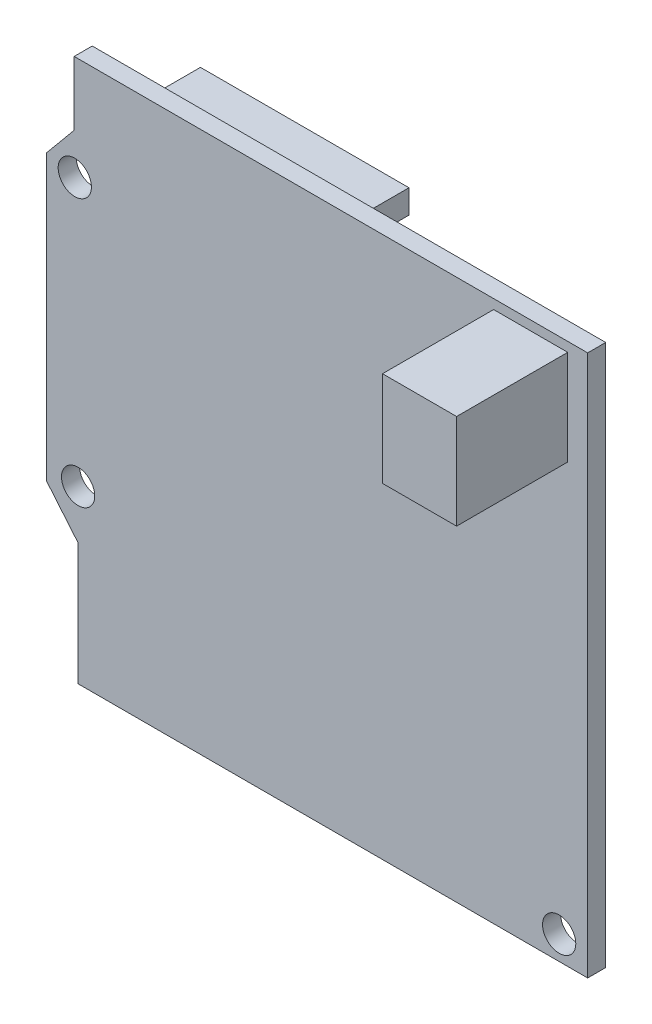
ISO-10303-21;
HEADER;
FILE_DESCRIPTION(('STEP AP214'),'2;1');
FILE_NAME('part.step','',(''),(''),'','','');
FILE_SCHEMA(('AUTOMOTIVE_DESIGN { 1 0 10303 214 1 1 1 1 }'));
ENDSEC;
DATA;
#1=APPLICATION_CONTEXT('core data for automotive mechanical design processes');
#2=APPLICATION_PROTOCOL_DEFINITION('international standard','automotive_design',2000,#1);
#3=PRODUCT_CONTEXT('',#1,'mechanical');
#4=PRODUCT('Part','Part','',(#3));
#5=PRODUCT_RELATED_PRODUCT_CATEGORY('part','',(#4));
#6=PRODUCT_DEFINITION_FORMATION('','',#4);
#7=PRODUCT_DEFINITION_CONTEXT('part definition',#1,'design');
#8=PRODUCT_DEFINITION('design','',#6,#7);
#9=PRODUCT_DEFINITION_SHAPE('','',#8);
#10=(LENGTH_UNIT() NAMED_UNIT(*) SI_UNIT(.MILLI.,.METRE.));
#11=(NAMED_UNIT(*) PLANE_ANGLE_UNIT() SI_UNIT($,.RADIAN.));
#12=(NAMED_UNIT(*) SI_UNIT($,.STERADIAN.) SOLID_ANGLE_UNIT());
#13=UNCERTAINTY_MEASURE_WITH_UNIT(LENGTH_MEASURE(1.E-05),#10,'distance_accuracy_value','');
#14=(GEOMETRIC_REPRESENTATION_CONTEXT(3) GLOBAL_UNCERTAINTY_ASSIGNED_CONTEXT((#13)) GLOBAL_UNIT_ASSIGNED_CONTEXT((#10,
#11,#12)) REPRESENTATION_CONTEXT('',''));
#15=CARTESIAN_POINT('',(0.,0.,0.));
#16=DIRECTION('',(0.,0.,1.));
#17=DIRECTION('',(1.,0.,0.));
#18=AXIS2_PLACEMENT_3D('',#15,#16,#17);
#19=CARTESIAN_POINT('',(-28.5,-28.5,10.4));
#20=DIRECTION('',(1.,0.,0.));
#21=DIRECTION('',(0.,0.,-1.));
#22=AXIS2_PLACEMENT_3D('',#19,#20,#21);
#23=PLANE('',#22);
#24=DIRECTION('',(0.,1.,0.));
#25=VECTOR('',#24,1.);
#26=CARTESIAN_POINT('',(-28.5,-11.6384737150526,8.5));
#27=LINE('',#26,#25);
#28=CARTESIAN_POINT('',(-28.5,-11.6384737150526,8.5));
#29=VERTEX_POINT('',#28);
#30=CARTESIAN_POINT('',(-28.5,18.2225744020547,8.5));
#31=VERTEX_POINT('',#30);
#32=EDGE_CURVE('E340',#29,#31,#27,.T.);
#33=ORIENTED_EDGE('',*,*,#32,.F.);
#34=DIRECTION('',(0.,0.,1.));
#35=VECTOR('',#34,1.);
#36=CARTESIAN_POINT('',(-28.5,-11.6384737150526,-0.000999999999997531));
#37=LINE('',#36,#35);
#38=CARTESIAN_POINT('',(-28.5,-11.6384737150526,10.4));
#39=VERTEX_POINT('',#38);
#40=EDGE_CURVE('E376',#29,#39,#37,.T.);
#41=ORIENTED_EDGE('',*,*,#40,.T.);
#42=DIRECTION('',(0.,-1.,0.));
#43=VECTOR('',#42,1.);
#44=CARTESIAN_POINT('',(-28.5,-28.5,10.4));
#45=LINE('',#44,#43);
#46=CARTESIAN_POINT('',(-28.5,18.2225744020547,10.4));
#47=VERTEX_POINT('',#46);
#48=EDGE_CURVE('E450',#47,#39,#45,.T.);
#49=ORIENTED_EDGE('',*,*,#48,.F.);
#50=DIRECTION('',(0.,0.,1.));
#51=VECTOR('',#50,1.);
#52=CARTESIAN_POINT('',(-28.5,18.2225744020547,-0.000999999999997531));
#53=LINE('',#52,#51);
#54=EDGE_CURVE('E388',#31,#47,#53,.T.);
#55=ORIENTED_EDGE('',*,*,#54,.F.);
#56=EDGE_LOOP('',(#33,#41,#49,#55));
#57=FACE_BOUND('',#56,.T.);
#58=ADVANCED_FACE('F54',(#57),#23,.F.);
#59=CARTESIAN_POINT('',(28.5,-28.5,10.4));
#60=DIRECTION('',(0.,1.,0.));
#61=DIRECTION('',(-1.,0.,0.));
#62=AXIS2_PLACEMENT_3D('',#59,#60,#61);
#63=PLANE('',#62);
#64=DIRECTION('',(-1.,0.,0.));
#65=VECTOR('',#64,1.);
#66=CARTESIAN_POINT('',(28.5,-28.5,8.5));
#67=LINE('',#66,#65);
#68=CARTESIAN_POINT('',(28.5,-28.5,8.5));
#69=VERTEX_POINT('',#68);
#70=CARTESIAN_POINT('',(-25.1693042757984,-28.5,8.5));
#71=VERTEX_POINT('',#70);
#72=EDGE_CURVE('E331',#69,#71,#67,.T.);
#73=ORIENTED_EDGE('',*,*,#72,.F.);
#74=DIRECTION('',(0.,0.,-1.));
#75=VECTOR('',#74,1.);
#76=CARTESIAN_POINT('',(28.5,-28.5,10.4));
#77=LINE('',#76,#75);
#78=CARTESIAN_POINT('',(28.5,-28.5,10.4));
#79=VERTEX_POINT('',#78);
#80=EDGE_CURVE('E13',#79,#69,#77,.T.);
#81=ORIENTED_EDGE('',*,*,#80,.F.);
#82=DIRECTION('',(1.,0.,0.));
#83=VECTOR('',#82,1.);
#84=CARTESIAN_POINT('',(28.5,-28.5,10.4));
#85=LINE('',#84,#83);
#86=CARTESIAN_POINT('',(-25.1693042757984,-28.5,10.4));
#87=VERTEX_POINT('',#86);
#88=EDGE_CURVE('E454',#87,#79,#85,.T.);
#89=ORIENTED_EDGE('',*,*,#88,.F.);
#90=DIRECTION('',(0.,0.,1.));
#91=VECTOR('',#90,1.);
#92=CARTESIAN_POINT('',(-25.1693042757984,-28.5,-0.000999999999997531));
#93=LINE('',#92,#91);
#94=EDGE_CURVE('E372',#71,#87,#93,.T.);
#95=ORIENTED_EDGE('',*,*,#94,.F.);
#96=EDGE_LOOP('',(#73,#81,#89,#95));
#97=FACE_BOUND('',#96,.T.);
#98=ADVANCED_FACE('F482',(#97),#63,.F.);
#99=CARTESIAN_POINT('',(28.5,-28.5,10.4));
#100=DIRECTION('',(-1.,0.,0.));
#101=DIRECTION('',(0.,0.,1.));
#102=AXIS2_PLACEMENT_3D('',#99,#100,#101);
#103=PLANE('',#102);
#104=DIRECTION('',(0.,-1.,0.));
#105=VECTOR('',#104,1.);
#106=CARTESIAN_POINT('',(28.5,28.5,8.5));
#107=LINE('',#106,#105);
#108=CARTESIAN_POINT('',(28.5,28.5,8.5));
#109=VERTEX_POINT('',#108);
#110=EDGE_CURVE('E320',#109,#69,#107,.T.);
#111=ORIENTED_EDGE('',*,*,#110,.F.);
#112=DIRECTION('',(0.,0.,-1.));
#113=VECTOR('',#112,1.);
#114=CARTESIAN_POINT('',(28.5,28.5,10.4));
#115=LINE('',#114,#113);
#116=CARTESIAN_POINT('',(28.5,28.5,10.4));
#117=VERTEX_POINT('',#116);
#118=EDGE_CURVE('E62',#117,#109,#115,.T.);
#119=ORIENTED_EDGE('',*,*,#118,.F.);
#120=DIRECTION('',(0.,1.,0.));
#121=VECTOR('',#120,1.);
#122=CARTESIAN_POINT('',(28.5,-28.5,10.4));
#123=LINE('',#122,#121);
#124=EDGE_CURVE('E457',#79,#117,#123,.T.);
#125=ORIENTED_EDGE('',*,*,#124,.F.);
#126=ORIENTED_EDGE('',*,*,#80,.T.);
#127=EDGE_LOOP('',(#111,#119,#125,#126));
#128=FACE_BOUND('',#127,.T.);
#129=ADVANCED_FACE('F474',(#128),#103,.F.);
#130=CARTESIAN_POINT('',(28.5,28.5,10.4));
#131=DIRECTION('',(0.,-1.,0.));
#132=DIRECTION('',(1.,0.,0.));
#133=AXIS2_PLACEMENT_3D('',#130,#131,#132);
#134=PLANE('',#133);
#135=DIRECTION('',(1.,0.,0.));
#136=VECTOR('',#135,1.);
#137=CARTESIAN_POINT('',(-25.5623795871642,28.5,8.5));
#138=LINE('',#137,#136);
#139=CARTESIAN_POINT('',(-25.5623795871642,28.5,8.5));
#140=VERTEX_POINT('',#139);
#141=EDGE_CURVE('E349',#140,#109,#138,.T.);
#142=ORIENTED_EDGE('',*,*,#141,.F.);
#143=DIRECTION('',(0.,0.,1.));
#144=VECTOR('',#143,1.);
#145=CARTESIAN_POINT('',(-25.5623795871642,28.5,-0.000999999999997531));
#146=LINE('',#145,#144);
#147=CARTESIAN_POINT('',(-25.5623795871642,28.5,10.4));
#148=VERTEX_POINT('',#147);
#149=EDGE_CURVE('E389',#140,#148,#146,.T.);
#150=ORIENTED_EDGE('',*,*,#149,.T.);
#151=DIRECTION('',(-1.,0.,0.));
#152=VECTOR('',#151,1.);
#153=CARTESIAN_POINT('',(28.5,28.5,10.4));
#154=LINE('',#153,#152);
#155=EDGE_CURVE('E460',#117,#148,#154,.T.);
#156=ORIENTED_EDGE('',*,*,#155,.F.);
#157=ORIENTED_EDGE('',*,*,#118,.T.);
#158=EDGE_LOOP('',(#142,#150,#156,#157));
#159=FACE_BOUND('',#158,.T.);
#160=ADVANCED_FACE('F469',(#159),#134,.F.);
#161=CARTESIAN_POINT('',(25.5,-26.,10.4));
#162=DIRECTION('',(0.,0.,1.));
#163=DIRECTION('',(1.,0.,0.));
#164=AXIS2_PLACEMENT_3D('',#161,#162,#163);
#165=CYLINDRICAL_SURFACE('',#164,1.75);
#166=CARTESIAN_POINT('',(25.5,-26.,10.4));
#167=DIRECTION('',(0.,0.,1.));
#168=DIRECTION('',(1.,0.,0.));
#169=AXIS2_PLACEMENT_3D('',#166,#167,#168);
#170=CIRCLE('',#169,1.75);
#171=CARTESIAN_POINT('',(27.25,-26.,10.4));
#172=VERTEX_POINT('',#171);
#173=EDGE_CURVE('E405',#172,#172,#170,.T.);
#174=ORIENTED_EDGE('',*,*,#173,.T.);
#175=EDGE_LOOP('',(#174));
#176=FACE_BOUND('',#175,.T.);
#177=CARTESIAN_POINT('',(25.5,-26.,8.5));
#178=DIRECTION('',(0.,0.,-1.));
#179=DIRECTION('',(-1.,0.,0.));
#180=AXIS2_PLACEMENT_3D('',#177,#178,#179);
#181=CIRCLE('',#180,1.75);
#182=CARTESIAN_POINT('',(23.75,-26.,8.5));
#183=VERTEX_POINT('',#182);
#184=EDGE_CURVE('E360',#183,#183,#181,.F.);
#185=ORIENTED_EDGE('',*,*,#184,.F.);
#186=EDGE_LOOP('',(#185));
#187=FACE_BOUND('',#186,.T.);
#188=ADVANCED_FACE('F532',(#176,#187),#165,.F.);
#189=CARTESIAN_POINT('',(-25.1486220444393,-10.5,10.4));
#190=DIRECTION('',(0.,0.,1.));
#191=DIRECTION('',(1.,0.,0.));
#192=AXIS2_PLACEMENT_3D('',#189,#190,#191);
#193=CYLINDRICAL_SURFACE('',#192,1.75);
#194=CARTESIAN_POINT('',(-25.1486220444393,-10.5,10.4));
#195=DIRECTION('',(0.,0.,1.));
#196=DIRECTION('',(1.,0.,0.));
#197=AXIS2_PLACEMENT_3D('',#194,#195,#196);
#198=CIRCLE('',#197,1.75);
#199=CARTESIAN_POINT('',(-23.3986220444393,-10.5,10.4));
#200=VERTEX_POINT('',#199);
#201=EDGE_CURVE('E401',#200,#200,#198,.T.);
#202=ORIENTED_EDGE('',*,*,#201,.T.);
#203=EDGE_LOOP('',(#202));
#204=FACE_BOUND('',#203,.T.);
#205=CARTESIAN_POINT('',(-25.1486220444393,-10.5,8.5));
#206=DIRECTION('',(0.,0.,-1.));
#207=DIRECTION('',(-1.,0.,0.));
#208=AXIS2_PLACEMENT_3D('',#205,#206,#207);
#209=CIRCLE('',#208,1.75);
#210=CARTESIAN_POINT('',(-26.8986220444393,-10.5,8.5));
#211=VERTEX_POINT('',#210);
#212=EDGE_CURVE('E356',#211,#211,#209,.F.);
#213=ORIENTED_EDGE('',*,*,#212,.F.);
#214=EDGE_LOOP('',(#213));
#215=FACE_BOUND('',#214,.T.);
#216=ADVANCED_FACE('F517',(#204,#215),#193,.F.);
#217=CARTESIAN_POINT('',(-25.5,17.5,10.4));
#218=DIRECTION('',(0.,0.,1.));
#219=DIRECTION('',(1.,0.,0.));
#220=AXIS2_PLACEMENT_3D('',#217,#218,#219);
#221=CYLINDRICAL_SURFACE('',#220,1.75);
#222=CARTESIAN_POINT('',(-25.5,17.5,10.4));
#223=DIRECTION('',(0.,0.,1.));
#224=DIRECTION('',(1.,0.,0.));
#225=AXIS2_PLACEMENT_3D('',#222,#223,#224);
#226=CIRCLE('',#225,1.75);
#227=CARTESIAN_POINT('',(-23.75,17.5,10.4));
#228=VERTEX_POINT('',#227);
#229=EDGE_CURVE('E392',#228,#228,#226,.T.);
#230=ORIENTED_EDGE('',*,*,#229,.T.);
#231=EDGE_LOOP('',(#230));
#232=FACE_BOUND('',#231,.T.);
#233=CARTESIAN_POINT('',(-25.5,17.5,8.5));
#234=DIRECTION('',(0.,0.,-1.));
#235=DIRECTION('',(-1.,0.,0.));
#236=AXIS2_PLACEMENT_3D('',#233,#234,#235);
#237=CIRCLE('',#236,1.75);
#238=CARTESIAN_POINT('',(-27.25,17.5,8.5));
#239=VERTEX_POINT('',#238);
#240=EDGE_CURVE('E352',#239,#239,#237,.F.);
#241=ORIENTED_EDGE('',*,*,#240,.F.);
#242=EDGE_LOOP('',(#241));
#243=FACE_BOUND('',#242,.T.);
#244=ADVANCED_FACE('F510',(#232,#243),#221,.F.);
#245=CARTESIAN_POINT('',(-25.5623795871642,28.5,-0.000999999999997531));
#246=DIRECTION('',(1.,0.,0.));
#247=DIRECTION('',(0.,0.,-1.));
#248=AXIS2_PLACEMENT_3D('',#245,#246,#247);
#249=PLANE('',#248);
#250=DIRECTION('',(0.,1.,0.));
#251=VECTOR('',#250,1.);
#252=CARTESIAN_POINT('',(-25.5623795871642,21.7695431605017,8.5));
#253=LINE('',#252,#251);
#254=CARTESIAN_POINT('',(-25.5623795871642,21.7695431605017,8.5));
#255=VERTEX_POINT('',#254);
#256=EDGE_CURVE('E346',#255,#140,#253,.T.);
#257=ORIENTED_EDGE('',*,*,#256,.F.);
#258=DIRECTION('',(0.,0.,1.));
#259=VECTOR('',#258,1.);
#260=CARTESIAN_POINT('',(-25.5623795871642,21.7695431605017,-0.000999999999997531));
#261=LINE('',#260,#259);
#262=CARTESIAN_POINT('',(-25.5623795871642,21.7695431605017,10.4));
#263=VERTEX_POINT('',#262);
#264=EDGE_CURVE('E393',#255,#263,#261,.T.);
#265=ORIENTED_EDGE('',*,*,#264,.T.);
#266=DIRECTION('',(0.,1.,0.));
#267=VECTOR('',#266,1.);
#268=CARTESIAN_POINT('',(-25.5623795871642,28.5,10.4));
#269=LINE('',#268,#267);
#270=EDGE_CURVE('E384',#263,#148,#269,.T.);
#271=ORIENTED_EDGE('',*,*,#270,.T.);
#272=ORIENTED_EDGE('',*,*,#149,.F.);
#273=EDGE_LOOP('',(#257,#265,#271,#272));
#274=FACE_BOUND('',#273,.T.);
#275=ADVANCED_FACE('F508',(#274),#249,.F.);
#276=CARTESIAN_POINT('',(-25.5623795871642,21.7695431605017,-0.000999999999997531));
#277=DIRECTION('',(0.770159852097772,-0.637850924759648,0.));
#278=DIRECTION('',(0.637850924759648,0.770159852097772,0.));
#279=AXIS2_PLACEMENT_3D('',#276,#277,#278);
#280=PLANE('',#279);
#281=DIRECTION('',(0.637850924759649,0.770159852097771,0.));
#282=VECTOR('',#281,1.);
#283=CARTESIAN_POINT('',(-28.5,18.2225744020547,8.5));
#284=LINE('',#283,#282);
#285=EDGE_CURVE('E343',#31,#255,#284,.T.);
#286=ORIENTED_EDGE('',*,*,#285,.F.);
#287=ORIENTED_EDGE('',*,*,#54,.T.);
#288=DIRECTION('',(0.637850924759648,0.770159852097772,0.));
#289=VECTOR('',#288,1.);
#290=CARTESIAN_POINT('',(-25.5623795871642,21.7695431605017,10.4));
#291=LINE('',#290,#289);
#292=EDGE_CURVE('E375',#47,#263,#291,.T.);
#293=ORIENTED_EDGE('',*,*,#292,.T.);
#294=ORIENTED_EDGE('',*,*,#264,.F.);
#295=EDGE_LOOP('',(#286,#287,#293,#294));
#296=FACE_BOUND('',#295,.T.);
#297=ADVANCED_FACE('F503',(#296),#280,.F.);
#298=CARTESIAN_POINT('',(-25.1693042757984,-28.5,-0.000999999999997531));
#299=DIRECTION('',(1.,0.,0.));
#300=DIRECTION('',(0.,0.,-1.));
#301=AXIS2_PLACEMENT_3D('',#298,#299,#300);
#302=PLANE('',#301);
#303=DIRECTION('',(0.,1.,0.));
#304=VECTOR('',#303,1.);
#305=CARTESIAN_POINT('',(-25.1693042757984,-28.5,8.5));
#306=LINE('',#305,#304);
#307=CARTESIAN_POINT('',(-25.1693042757984,-15.622117115454,8.5));
#308=VERTEX_POINT('',#307);
#309=EDGE_CURVE('E334',#71,#308,#306,.T.);
#310=ORIENTED_EDGE('',*,*,#309,.F.);
#311=ORIENTED_EDGE('',*,*,#94,.T.);
#312=DIRECTION('',(0.,1.,0.));
#313=VECTOR('',#312,1.);
#314=CARTESIAN_POINT('',(-25.1693042757984,-28.5,10.4));
#315=LINE('',#314,#313);
#316=CARTESIAN_POINT('',(-25.1693042757984,-15.622117115454,10.4));
#317=VERTEX_POINT('',#316);
#318=EDGE_CURVE('E363',#87,#317,#315,.T.);
#319=ORIENTED_EDGE('',*,*,#318,.T.);
#320=DIRECTION('',(0.,0.,1.));
#321=VECTOR('',#320,1.);
#322=CARTESIAN_POINT('',(-25.1693042757984,-15.622117115454,-0.000999999999997531));
#323=LINE('',#322,#321);
#324=EDGE_CURVE('E371',#308,#317,#323,.T.);
#325=ORIENTED_EDGE('',*,*,#324,.F.);
#326=EDGE_LOOP('',(#310,#311,#319,#325));
#327=FACE_BOUND('',#326,.T.);
#328=ADVANCED_FACE('F486',(#327),#302,.F.);
#329=CARTESIAN_POINT('',(-25.1693042757984,-15.622117115454,-0.000999999999997531));
#330=DIRECTION('',(0.767179098449286,0.641432951213563,0.));
#331=DIRECTION('',(-0.641432951213563,0.767179098449286,0.));
#332=AXIS2_PLACEMENT_3D('',#329,#330,#331);
#333=PLANE('',#332);
#334=DIRECTION('',(-0.641432951213562,0.767179098449286,0.));
#335=VECTOR('',#334,1.);
#336=CARTESIAN_POINT('',(-25.1693042757984,-15.622117115454,8.5));
#337=LINE('',#336,#335);
#338=EDGE_CURVE('E337',#308,#29,#337,.T.);
#339=ORIENTED_EDGE('',*,*,#338,.F.);
#340=ORIENTED_EDGE('',*,*,#324,.T.);
#341=DIRECTION('',(-0.641432951213563,0.767179098449286,0.));
#342=VECTOR('',#341,1.);
#343=CARTESIAN_POINT('',(-25.1693042757984,-15.622117115454,10.4));
#344=LINE('',#343,#342);
#345=EDGE_CURVE('E367',#317,#39,#344,.T.);
#346=ORIENTED_EDGE('',*,*,#345,.T.);
#347=ORIENTED_EDGE('',*,*,#40,.F.);
#348=EDGE_LOOP('',(#339,#340,#346,#347));
#349=FACE_BOUND('',#348,.T.);
#350=ADVANCED_FACE('F497',(#349),#333,.F.);
#351=CARTESIAN_POINT('',(0.,0.,10.4));
#352=DIRECTION('',(0.,0.,1.));
#353=DIRECTION('',(1.,0.,0.));
#354=AXIS2_PLACEMENT_3D('',#351,#352,#353);
#355=PLANE('',#354);
#356=ORIENTED_EDGE('',*,*,#318,.F.);
#357=ORIENTED_EDGE('',*,*,#88,.T.);
#358=ORIENTED_EDGE('',*,*,#124,.T.);
#359=ORIENTED_EDGE('',*,*,#155,.T.);
#360=ORIENTED_EDGE('',*,*,#270,.F.);
#361=ORIENTED_EDGE('',*,*,#292,.F.);
#362=ORIENTED_EDGE('',*,*,#48,.T.);
#363=ORIENTED_EDGE('',*,*,#345,.F.);
#364=EDGE_LOOP('',(#356,#357,#358,#359,#360,#361,#362,#363));
#365=FACE_BOUND('',#364,.T.);
#366=ORIENTED_EDGE('',*,*,#229,.F.);
#367=EDGE_LOOP('',(#366));
#368=FACE_BOUND('',#367,.T.);
#369=ORIENTED_EDGE('',*,*,#201,.F.);
#370=EDGE_LOOP('',(#369));
#371=FACE_BOUND('',#370,.T.);
#372=ORIENTED_EDGE('',*,*,#173,.F.);
#373=EDGE_LOOP('',(#372));
#374=FACE_BOUND('',#373,.T.);
#375=DIRECTION('',(1.,0.,0.));
#376=VECTOR('',#375,1.);
#377=CARTESIAN_POINT('',(26.4,17.5,10.4));
#378=LINE('',#377,#376);
#379=CARTESIAN_POINT('',(18.6,17.5,10.4));
#380=VERTEX_POINT('',#379);
#381=CARTESIAN_POINT('',(26.4,17.5,10.4));
#382=VERTEX_POINT('',#381);
#383=EDGE_CURVE('E428',#380,#382,#378,.T.);
#384=ORIENTED_EDGE('',*,*,#383,.F.);
#385=DIRECTION('',(0.,-1.,0.));
#386=VECTOR('',#385,1.);
#387=CARTESIAN_POINT('',(18.6,27.5,10.4));
#388=LINE('',#387,#386);
#389=CARTESIAN_POINT('',(18.6,27.5,10.4));
#390=VERTEX_POINT('',#389);
#391=EDGE_CURVE('E409',#390,#380,#388,.T.);
#392=ORIENTED_EDGE('',*,*,#391,.F.);
#393=DIRECTION('',(-1.,0.,0.));
#394=VECTOR('',#393,1.);
#395=CARTESIAN_POINT('',(26.4,27.5,10.4));
#396=LINE('',#395,#394);
#397=CARTESIAN_POINT('',(26.4,27.5,10.4));
#398=VERTEX_POINT('',#397);
#399=EDGE_CURVE('E415',#398,#390,#396,.T.);
#400=ORIENTED_EDGE('',*,*,#399,.F.);
#401=DIRECTION('',(0.,1.,0.));
#402=VECTOR('',#401,1.);
#403=CARTESIAN_POINT('',(26.4,27.5,10.4));
#404=LINE('',#403,#402);
#405=EDGE_CURVE('E431',#382,#398,#404,.T.);
#406=ORIENTED_EDGE('',*,*,#405,.F.);
#407=EDGE_LOOP('',(#384,#392,#400,#406));
#408=FACE_BOUND('',#407,.T.);
#409=ADVANCED_FACE('F490',(#365,#368,#371,#374,#408),#355,.T.);
#410=CARTESIAN_POINT('',(18.6,27.5,22.1));
#411=DIRECTION('',(1.,0.,0.));
#412=DIRECTION('',(0.,0.,-1.));
#413=AXIS2_PLACEMENT_3D('',#410,#411,#412);
#414=PLANE('',#413);
#415=ORIENTED_EDGE('',*,*,#391,.T.);
#416=DIRECTION('',(0.,0.,-1.));
#417=VECTOR('',#416,1.);
#418=CARTESIAN_POINT('',(18.6,17.5,22.1));
#419=LINE('',#418,#417);
#420=CARTESIAN_POINT('',(18.6,17.5,22.1));
#421=VERTEX_POINT('',#420);
#422=EDGE_CURVE('E447',#421,#380,#419,.T.);
#423=ORIENTED_EDGE('',*,*,#422,.F.);
#424=DIRECTION('',(0.,-1.,0.));
#425=VECTOR('',#424,1.);
#426=CARTESIAN_POINT('',(18.6,27.5,22.1));
#427=LINE('',#426,#425);
#428=CARTESIAN_POINT('',(18.6,27.5,22.1));
#429=VERTEX_POINT('',#428);
#430=EDGE_CURVE('E410',#429,#421,#427,.T.);
#431=ORIENTED_EDGE('',*,*,#430,.F.);
#432=DIRECTION('',(0.,0.,-1.));
#433=VECTOR('',#432,1.);
#434=CARTESIAN_POINT('',(18.6,27.5,22.1));
#435=LINE('',#434,#433);
#436=EDGE_CURVE('E424',#429,#390,#435,.T.);
#437=ORIENTED_EDGE('',*,*,#436,.T.);
#438=EDGE_LOOP('',(#415,#423,#431,#437));
#439=FACE_BOUND('',#438,.T.);
#440=ADVANCED_FACE('F540',(#439),#414,.F.);
#441=CARTESIAN_POINT('',(26.4,17.5,22.1));
#442=DIRECTION('',(0.,1.,0.));
#443=DIRECTION('',(0.,0.,1.));
#444=AXIS2_PLACEMENT_3D('',#441,#442,#443);
#445=PLANE('',#444);
#446=ORIENTED_EDGE('',*,*,#383,.T.);
#447=DIRECTION('',(0.,0.,-1.));
#448=VECTOR('',#447,1.);
#449=CARTESIAN_POINT('',(26.4,17.5,22.1));
#450=LINE('',#449,#448);
#451=CARTESIAN_POINT('',(26.4,17.5,22.1));
#452=VERTEX_POINT('',#451);
#453=EDGE_CURVE('E443',#452,#382,#450,.T.);
#454=ORIENTED_EDGE('',*,*,#453,.F.);
#455=DIRECTION('',(1.,0.,0.));
#456=VECTOR('',#455,1.);
#457=CARTESIAN_POINT('',(26.4,17.5,22.1));
#458=LINE('',#457,#456);
#459=EDGE_CURVE('E414',#421,#452,#458,.T.);
#460=ORIENTED_EDGE('',*,*,#459,.F.);
#461=ORIENTED_EDGE('',*,*,#422,.T.);
#462=EDGE_LOOP('',(#446,#454,#460,#461));
#463=FACE_BOUND('',#462,.T.);
#464=ADVANCED_FACE('F543',(#463),#445,.F.);
#465=CARTESIAN_POINT('',(26.4,27.5,22.1));
#466=DIRECTION('',(-1.,0.,0.));
#467=DIRECTION('',(0.,0.,1.));
#468=AXIS2_PLACEMENT_3D('',#465,#466,#467);
#469=PLANE('',#468);
#470=ORIENTED_EDGE('',*,*,#405,.T.);
#471=DIRECTION('',(0.,0.,-1.));
#472=VECTOR('',#471,1.);
#473=CARTESIAN_POINT('',(26.4,27.5,22.1));
#474=LINE('',#473,#472);
#475=CARTESIAN_POINT('',(26.4,27.5,22.1));
#476=VERTEX_POINT('',#475);
#477=EDGE_CURVE('E440',#476,#398,#474,.T.);
#478=ORIENTED_EDGE('',*,*,#477,.F.);
#479=DIRECTION('',(0.,1.,0.));
#480=VECTOR('',#479,1.);
#481=CARTESIAN_POINT('',(26.4,27.5,22.1));
#482=LINE('',#481,#480);
#483=EDGE_CURVE('E418',#452,#476,#482,.T.);
#484=ORIENTED_EDGE('',*,*,#483,.F.);
#485=ORIENTED_EDGE('',*,*,#453,.T.);
#486=EDGE_LOOP('',(#470,#478,#484,#485));
#487=FACE_BOUND('',#486,.T.);
#488=ADVANCED_FACE('F547',(#487),#469,.F.);
#489=CARTESIAN_POINT('',(26.4,27.5,22.1));
#490=DIRECTION('',(0.,-1.,0.));
#491=DIRECTION('',(0.,0.,-1.));
#492=AXIS2_PLACEMENT_3D('',#489,#490,#491);
#493=PLANE('',#492);
#494=ORIENTED_EDGE('',*,*,#399,.T.);
#495=ORIENTED_EDGE('',*,*,#436,.F.);
#496=DIRECTION('',(-1.,0.,0.));
#497=VECTOR('',#496,1.);
#498=CARTESIAN_POINT('',(26.4,27.5,22.1));
#499=LINE('',#498,#497);
#500=EDGE_CURVE('E421',#476,#429,#499,.T.);
#501=ORIENTED_EDGE('',*,*,#500,.F.);
#502=ORIENTED_EDGE('',*,*,#477,.T.);
#503=EDGE_LOOP('',(#494,#495,#501,#502));
#504=FACE_BOUND('',#503,.T.);
#505=ADVANCED_FACE('F551',(#504),#493,.F.);
#506=CARTESIAN_POINT('',(0.,0.,22.1));
#507=DIRECTION('',(0.,0.,-1.));
#508=DIRECTION('',(-1.,0.,0.));
#509=AXIS2_PLACEMENT_3D('',#506,#507,#508);
#510=PLANE('',#509);
#511=ORIENTED_EDGE('',*,*,#430,.T.);
#512=ORIENTED_EDGE('',*,*,#459,.T.);
#513=ORIENTED_EDGE('',*,*,#483,.T.);
#514=ORIENTED_EDGE('',*,*,#500,.T.);
#515=EDGE_LOOP('',(#511,#512,#513,#514));
#516=FACE_BOUND('',#515,.T.);
#517=ADVANCED_FACE('F555',(#516),#510,.F.);
#518=CARTESIAN_POINT('',(0.,0.,8.5));
#519=DIRECTION('',(0.,0.,-1.));
#520=DIRECTION('',(-1.,0.,0.));
#521=AXIS2_PLACEMENT_3D('',#518,#519,#520);
#522=PLANE('',#521);
#523=DIRECTION('',(1.,0.,0.));
#524=VECTOR('',#523,1.);
#525=CARTESIAN_POINT('',(19.3306957242016,-25.,8.5));
#526=LINE('',#525,#524);
#527=CARTESIAN_POINT('',(-22.6693042757984,-25.,8.5));
#528=VERTEX_POINT('',#527);
#529=CARTESIAN_POINT('',(19.3306957242016,-25.,8.5));
#530=VERTEX_POINT('',#529);
#531=EDGE_CURVE('E245',#528,#530,#526,.T.);
#532=ORIENTED_EDGE('',*,*,#531,.F.);
#533=DIRECTION('',(0.,1.,0.));
#534=VECTOR('',#533,1.);
#535=CARTESIAN_POINT('',(-22.6693042757984,-25.,8.5));
#536=LINE('',#535,#534);
#537=CARTESIAN_POINT('',(-22.6693042757984,-27.5,8.5));
#538=VERTEX_POINT('',#537);
#539=EDGE_CURVE('E255',#538,#528,#536,.T.);
#540=ORIENTED_EDGE('',*,*,#539,.F.);
#541=DIRECTION('',(-1.,0.,0.));
#542=VECTOR('',#541,1.);
#543=CARTESIAN_POINT('',(19.3306957242016,-27.5,8.5));
#544=LINE('',#543,#542);
#545=CARTESIAN_POINT('',(19.3306957242016,-27.5,8.5));
#546=VERTEX_POINT('',#545);
#547=EDGE_CURVE('E236',#546,#538,#544,.T.);
#548=ORIENTED_EDGE('',*,*,#547,.F.);
#549=DIRECTION('',(0.,-1.,0.));
#550=VECTOR('',#549,1.);
#551=CARTESIAN_POINT('',(19.3306957242016,-25.,8.5));
#552=LINE('',#551,#550);
#553=EDGE_CURVE('E252',#530,#546,#552,.T.);
#554=ORIENTED_EDGE('',*,*,#553,.F.);
#555=EDGE_LOOP('',(#532,#540,#548,#554));
#556=FACE_BOUND('',#555,.T.);
#557=DIRECTION('',(1.,0.,0.));
#558=VECTOR('',#557,1.);
#559=CARTESIAN_POINT('',(-0.713115612686929,23.75,8.5));
#560=LINE('',#559,#558);
#561=CARTESIAN_POINT('',(-22.6693042757984,23.75,8.5));
#562=VERTEX_POINT('',#561);
#563=CARTESIAN_POINT('',(-0.713115612686929,23.75,8.5));
#564=VERTEX_POINT('',#563);
#565=EDGE_CURVE('E300',#562,#564,#560,.T.);
#566=ORIENTED_EDGE('',*,*,#565,.F.);
#567=DIRECTION('',(0.,1.,0.));
#568=VECTOR('',#567,1.);
#569=CARTESIAN_POINT('',(-22.6693042757984,23.75,8.5));
#570=LINE('',#569,#568);
#571=CARTESIAN_POINT('',(-22.6693042757984,21.25,8.5));
#572=VERTEX_POINT('',#571);
#573=EDGE_CURVE('E296',#572,#562,#570,.T.);
#574=ORIENTED_EDGE('',*,*,#573,.F.);
#575=DIRECTION('',(-1.,0.,0.));
#576=VECTOR('',#575,1.);
#577=CARTESIAN_POINT('',(-0.713115612686929,21.25,8.5));
#578=LINE('',#577,#576);
#579=CARTESIAN_POINT('',(-0.713115612686929,21.25,8.5));
#580=VERTEX_POINT('',#579);
#581=EDGE_CURVE('E291',#580,#572,#578,.T.);
#582=ORIENTED_EDGE('',*,*,#581,.F.);
#583=DIRECTION('',(0.,-1.,0.));
#584=VECTOR('',#583,1.);
#585=CARTESIAN_POINT('',(-0.713115612686929,23.75,8.5));
#586=LINE('',#585,#584);
#587=EDGE_CURVE('E287',#564,#580,#586,.T.);
#588=ORIENTED_EDGE('',*,*,#587,.F.);
#589=EDGE_LOOP('',(#566,#574,#582,#588));
#590=FACE_BOUND('',#589,.T.);
#591=ORIENTED_EDGE('',*,*,#110,.T.);
#592=ORIENTED_EDGE('',*,*,#72,.T.);
#593=ORIENTED_EDGE('',*,*,#309,.T.);
#594=ORIENTED_EDGE('',*,*,#338,.T.);
#595=ORIENTED_EDGE('',*,*,#32,.T.);
#596=ORIENTED_EDGE('',*,*,#285,.T.);
#597=ORIENTED_EDGE('',*,*,#256,.T.);
#598=ORIENTED_EDGE('',*,*,#141,.T.);
#599=EDGE_LOOP('',(#591,#592,#593,#594,#595,#596,#597,#598));
#600=FACE_BOUND('',#599,.T.);
#601=ORIENTED_EDGE('',*,*,#240,.T.);
#602=EDGE_LOOP('',(#601));
#603=FACE_BOUND('',#602,.T.);
#604=ORIENTED_EDGE('',*,*,#212,.T.);
#605=EDGE_LOOP('',(#604));
#606=FACE_BOUND('',#605,.T.);
#607=ORIENTED_EDGE('',*,*,#184,.T.);
#608=EDGE_LOOP('',(#607));
#609=FACE_BOUND('',#608,.T.);
#610=ADVANCED_FACE('F250',(#556,#590,#600,#603,#606,#609),#522,.T.);
#611=CARTESIAN_POINT('',(-0.713115612686929,23.75,8.5));
#612=DIRECTION('',(1.,0.,0.));
#613=DIRECTION('',(0.,1.,0.));
#614=AXIS2_PLACEMENT_3D('',#611,#612,#613);
#615=PLANE('',#614);
#616=DIRECTION('',(0.,-1.,0.));
#617=VECTOR('',#616,1.);
#618=CARTESIAN_POINT('',(-0.713115612686929,23.75,0.));
#619=LINE('',#618,#617);
#620=CARTESIAN_POINT('',(-0.713115612686929,23.75,0.));
#621=VERTEX_POINT('',#620);
#622=CARTESIAN_POINT('',(-0.713115612686929,21.25,0.));
#623=VERTEX_POINT('',#622);
#624=EDGE_CURVE('E281',#621,#623,#619,.T.);
#625=ORIENTED_EDGE('',*,*,#624,.F.);
#626=DIRECTION('',(0.,0.,-1.));
#627=VECTOR('',#626,1.);
#628=CARTESIAN_POINT('',(-0.713115612686929,23.75,8.5));
#629=LINE('',#628,#627);
#630=EDGE_CURVE('E317',#564,#621,#629,.T.);
#631=ORIENTED_EDGE('',*,*,#630,.F.);
#632=ORIENTED_EDGE('',*,*,#587,.T.);
#633=DIRECTION('',(0.,0.,-1.));
#634=VECTOR('',#633,1.);
#635=CARTESIAN_POINT('',(-0.713115612686929,21.25,8.5));
#636=LINE('',#635,#634);
#637=EDGE_CURVE('E304',#580,#623,#636,.T.);
#638=ORIENTED_EDGE('',*,*,#637,.T.);
#639=EDGE_LOOP('',(#625,#631,#632,#638));
#640=FACE_BOUND('',#639,.T.);
#641=ADVANCED_FACE('F573',(#640),#615,.T.);
#642=CARTESIAN_POINT('',(-0.713115612686929,23.75,8.5));
#643=DIRECTION('',(0.,1.,0.));
#644=DIRECTION('',(0.,0.,1.));
#645=AXIS2_PLACEMENT_3D('',#642,#643,#644);
#646=PLANE('',#645);
#647=DIRECTION('',(1.,0.,0.));
#648=VECTOR('',#647,1.);
#649=CARTESIAN_POINT('',(-0.713115612686929,23.75,0.));
#650=LINE('',#649,#648);
#651=CARTESIAN_POINT('',(-22.6693042757984,23.75,0.));
#652=VERTEX_POINT('',#651);
#653=EDGE_CURVE('E292',#652,#621,#650,.T.);
#654=ORIENTED_EDGE('',*,*,#653,.F.);
#655=DIRECTION('',(0.,0.,-1.));
#656=VECTOR('',#655,1.);
#657=CARTESIAN_POINT('',(-22.6693042757984,23.75,8.5));
#658=LINE('',#657,#656);
#659=EDGE_CURVE('E321',#562,#652,#658,.T.);
#660=ORIENTED_EDGE('',*,*,#659,.F.);
#661=ORIENTED_EDGE('',*,*,#565,.T.);
#662=ORIENTED_EDGE('',*,*,#630,.T.);
#663=EDGE_LOOP('',(#654,#660,#661,#662));
#664=FACE_BOUND('',#663,.T.);
#665=ADVANCED_FACE('F580',(#664),#646,.T.);
#666=CARTESIAN_POINT('',(-22.6693042757984,23.75,8.5));
#667=DIRECTION('',(-1.,0.,0.));
#668=DIRECTION('',(0.,0.,1.));
#669=AXIS2_PLACEMENT_3D('',#666,#667,#668);
#670=PLANE('',#669);
#671=DIRECTION('',(0.,1.,0.));
#672=VECTOR('',#671,1.);
#673=CARTESIAN_POINT('',(-22.6693042757984,23.75,0.));
#674=LINE('',#673,#672);
#675=CARTESIAN_POINT('',(-22.6693042757984,21.25,0.));
#676=VERTEX_POINT('',#675);
#677=EDGE_CURVE('E72',#676,#652,#674,.T.);
#678=ORIENTED_EDGE('',*,*,#677,.F.);
#679=DIRECTION('',(0.,0.,-1.));
#680=VECTOR('',#679,1.);
#681=CARTESIAN_POINT('',(-22.6693042757984,21.25,8.5));
#682=LINE('',#681,#680);
#683=EDGE_CURVE('E324',#572,#676,#682,.T.);
#684=ORIENTED_EDGE('',*,*,#683,.F.);
#685=ORIENTED_EDGE('',*,*,#573,.T.);
#686=ORIENTED_EDGE('',*,*,#659,.T.);
#687=EDGE_LOOP('',(#678,#684,#685,#686));
#688=FACE_BOUND('',#687,.T.);
#689=ADVANCED_FACE('F675',(#688),#670,.T.);
#690=CARTESIAN_POINT('',(-0.713115612686929,21.25,8.5));
#691=DIRECTION('',(0.,-1.,0.));
#692=DIRECTION('',(0.,0.,-1.));
#693=AXIS2_PLACEMENT_3D('',#690,#691,#692);
#694=PLANE('',#693);
#695=DIRECTION('',(-1.,0.,0.));
#696=VECTOR('',#695,1.);
#697=CARTESIAN_POINT('',(-0.713115612686929,21.25,0.));
#698=LINE('',#697,#696);
#699=EDGE_CURVE('E308',#623,#676,#698,.T.);
#700=ORIENTED_EDGE('',*,*,#699,.F.);
#701=ORIENTED_EDGE('',*,*,#637,.F.);
#702=ORIENTED_EDGE('',*,*,#581,.T.);
#703=ORIENTED_EDGE('',*,*,#683,.T.);
#704=EDGE_LOOP('',(#700,#701,#702,#703));
#705=FACE_BOUND('',#704,.T.);
#706=ADVANCED_FACE('F682',(#705),#694,.T.);
#707=CARTESIAN_POINT('',(19.3306957242016,-25.,8.5));
#708=DIRECTION('',(1.,0.,0.));
#709=DIRECTION('',(0.,0.,-1.));
#710=AXIS2_PLACEMENT_3D('',#707,#708,#709);
#711=PLANE('',#710);
#712=DIRECTION('',(0.,-1.,0.));
#713=VECTOR('',#712,1.);
#714=CARTESIAN_POINT('',(19.3306957242016,-25.,0.));
#715=LINE('',#714,#713);
#716=CARTESIAN_POINT('',(19.3306957242016,-25.,0.));
#717=VERTEX_POINT('',#716);
#718=CARTESIAN_POINT('',(19.3306957242016,-27.5,0.));
#719=VERTEX_POINT('',#718);
#720=EDGE_CURVE('E273',#717,#719,#715,.T.);
#721=ORIENTED_EDGE('',*,*,#720,.F.);
#722=DIRECTION('',(0.,0.,-1.));
#723=VECTOR('',#722,1.);
#724=CARTESIAN_POINT('',(19.3306957242016,-25.,8.5));
#725=LINE('',#724,#723);
#726=EDGE_CURVE('E259',#530,#717,#725,.T.);
#727=ORIENTED_EDGE('',*,*,#726,.F.);
#728=ORIENTED_EDGE('',*,*,#553,.T.);
#729=DIRECTION('',(0.,0.,-1.));
#730=VECTOR('',#729,1.);
#731=CARTESIAN_POINT('',(19.3306957242016,-27.5,8.5));
#732=LINE('',#731,#730);
#733=EDGE_CURVE('E233',#546,#719,#732,.T.);
#734=ORIENTED_EDGE('',*,*,#733,.T.);
#735=EDGE_LOOP('',(#721,#727,#728,#734));
#736=FACE_BOUND('',#735,.T.);
#737=ADVANCED_FACE('F258',(#736),#711,.T.);
#738=CARTESIAN_POINT('',(19.3306957242016,-25.,8.5));
#739=DIRECTION('',(0.,1.,0.));
#740=DIRECTION('',(0.,0.,1.));
#741=AXIS2_PLACEMENT_3D('',#738,#739,#740);
#742=PLANE('',#741);
#743=DIRECTION('',(1.,0.,0.));
#744=VECTOR('',#743,1.);
#745=CARTESIAN_POINT('',(19.3306957242016,-25.,0.));
#746=LINE('',#745,#744);
#747=CARTESIAN_POINT('',(-22.6693042757984,-25.,0.));
#748=VERTEX_POINT('',#747);
#749=EDGE_CURVE('E261',#748,#717,#746,.T.);
#750=ORIENTED_EDGE('',*,*,#749,.F.);
#751=DIRECTION('',(0.,0.,-1.));
#752=VECTOR('',#751,1.);
#753=CARTESIAN_POINT('',(-22.6693042757984,-25.,8.5));
#754=LINE('',#753,#752);
#755=EDGE_CURVE('E282',#528,#748,#754,.T.);
#756=ORIENTED_EDGE('',*,*,#755,.F.);
#757=ORIENTED_EDGE('',*,*,#531,.T.);
#758=ORIENTED_EDGE('',*,*,#726,.T.);
#759=EDGE_LOOP('',(#750,#756,#757,#758));
#760=FACE_BOUND('',#759,.T.);
#761=ADVANCED_FACE('F694',(#760),#742,.T.);
#762=CARTESIAN_POINT('',(-22.6693042757984,-25.,8.5));
#763=DIRECTION('',(-1.,0.,0.));
#764=DIRECTION('',(0.,0.,1.));
#765=AXIS2_PLACEMENT_3D('',#762,#763,#764);
#766=PLANE('',#765);
#767=DIRECTION('',(0.,1.,0.));
#768=VECTOR('',#767,1.);
#769=CARTESIAN_POINT('',(-22.6693042757984,-25.,0.));
#770=LINE('',#769,#768);
#771=CARTESIAN_POINT('',(-22.6693042757984,-27.5,0.));
#772=VERTEX_POINT('',#771);
#773=EDGE_CURVE('E83',#772,#748,#770,.T.);
#774=ORIENTED_EDGE('',*,*,#773,.F.);
#775=DIRECTION('',(0.,0.,-1.));
#776=VECTOR('',#775,1.);
#777=CARTESIAN_POINT('',(-22.6693042757984,-27.5,8.5));
#778=LINE('',#777,#776);
#779=EDGE_CURVE('E244',#538,#772,#778,.T.);
#780=ORIENTED_EDGE('',*,*,#779,.F.);
#781=ORIENTED_EDGE('',*,*,#539,.T.);
#782=ORIENTED_EDGE('',*,*,#755,.T.);
#783=EDGE_LOOP('',(#774,#780,#781,#782));
#784=FACE_BOUND('',#783,.T.);
#785=ADVANCED_FACE('F701',(#784),#766,.T.);
#786=CARTESIAN_POINT('',(19.3306957242016,-27.5,8.5));
#787=DIRECTION('',(0.,-1.,0.));
#788=DIRECTION('',(0.,0.,-1.));
#789=AXIS2_PLACEMENT_3D('',#786,#787,#788);
#790=PLANE('',#789);
#791=DIRECTION('',(-1.,0.,0.));
#792=VECTOR('',#791,1.);
#793=CARTESIAN_POINT('',(19.3306957242016,-27.5,0.));
#794=LINE('',#793,#792);
#795=EDGE_CURVE('E238',#719,#772,#794,.T.);
#796=ORIENTED_EDGE('',*,*,#795,.F.);
#797=ORIENTED_EDGE('',*,*,#733,.F.);
#798=ORIENTED_EDGE('',*,*,#547,.T.);
#799=ORIENTED_EDGE('',*,*,#779,.T.);
#800=EDGE_LOOP('',(#796,#797,#798,#799));
#801=FACE_BOUND('',#800,.T.);
#802=ADVANCED_FACE('F235',(#801),#790,.T.);
#803=CARTESIAN_POINT('',(0.,0.,0.));
#804=DIRECTION('',(0.,0.,1.));
#805=DIRECTION('',(1.,0.,0.));
#806=AXIS2_PLACEMENT_3D('',#803,#804,#805);
#807=PLANE('',#806);
#808=ORIENTED_EDGE('',*,*,#720,.T.);
#809=ORIENTED_EDGE('',*,*,#795,.T.);
#810=ORIENTED_EDGE('',*,*,#773,.T.);
#811=ORIENTED_EDGE('',*,*,#749,.T.);
#812=EDGE_LOOP('',(#808,#809,#810,#811));
#813=FACE_BOUND('',#812,.T.);
#814=ADVANCED_FACE('F536',(#813),#807,.F.);
#815=ORIENTED_EDGE('',*,*,#624,.T.);
#816=ORIENTED_EDGE('',*,*,#699,.T.);
#817=ORIENTED_EDGE('',*,*,#677,.T.);
#818=ORIENTED_EDGE('',*,*,#653,.T.);
#819=EDGE_LOOP('',(#815,#816,#817,#818));
#820=FACE_BOUND('',#819,.T.);
#821=ADVANCED_FACE('F533',(#820),#807,.F.);
#822=CLOSED_SHELL('',(#58,#98,#129,#160,#188,#216,#244,#275,#297,#328,#350,#409,#440,#464,#488,
#505,#517,#610,#641,#665,#689,#706,#737,#761,#785,#802,#814,#821));
#823=MANIFOLD_SOLID_BREP('B2',#822);
#824=ADVANCED_BREP_SHAPE_REPRESENTATION('',(#18,#823),#14);
#825=SHAPE_DEFINITION_REPRESENTATION(#9,#824);
ENDSEC;
END-ISO-10303-21;
